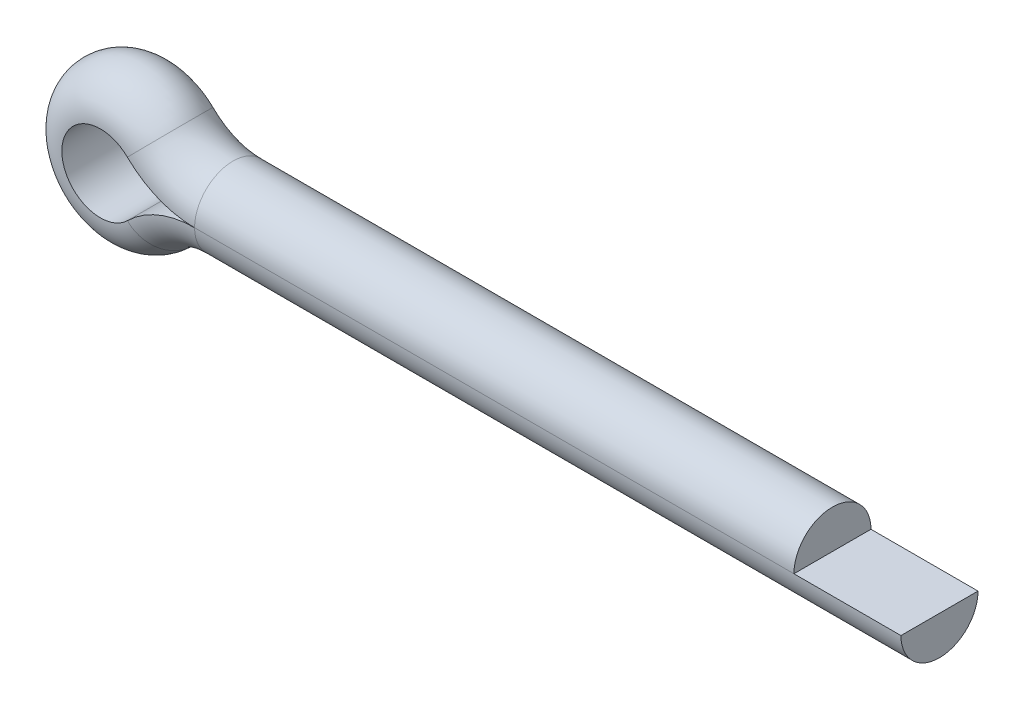
ISO-10303-21;
HEADER;
FILE_DESCRIPTION(('STEP AP214'),'2;1');
FILE_NAME('part.step','',(''),(''),'','','');
FILE_SCHEMA(('AUTOMOTIVE_DESIGN { 1 0 10303 214 1 1 1 1 }'));
ENDSEC;
DATA;
#1=APPLICATION_CONTEXT('core data for automotive mechanical design processes');
#2=APPLICATION_PROTOCOL_DEFINITION('international standard','automotive_design',2000,#1);
#3=PRODUCT_CONTEXT('',#1,'mechanical');
#4=PRODUCT('Part','Part','',(#3));
#5=PRODUCT_RELATED_PRODUCT_CATEGORY('part','',(#4));
#6=PRODUCT_DEFINITION_FORMATION('','',#4);
#7=PRODUCT_DEFINITION_CONTEXT('part definition',#1,'design');
#8=PRODUCT_DEFINITION('design','',#6,#7);
#9=PRODUCT_DEFINITION_SHAPE('','',#8);
#10=(LENGTH_UNIT() NAMED_UNIT(*) SI_UNIT(.MILLI.,.METRE.));
#11=(NAMED_UNIT(*) PLANE_ANGLE_UNIT() SI_UNIT($,.RADIAN.));
#12=(NAMED_UNIT(*) SI_UNIT($,.STERADIAN.) SOLID_ANGLE_UNIT());
#13=UNCERTAINTY_MEASURE_WITH_UNIT(LENGTH_MEASURE(1.E-05),#10,'distance_accuracy_value','');
#14=(GEOMETRIC_REPRESENTATION_CONTEXT(3) GLOBAL_UNCERTAINTY_ASSIGNED_CONTEXT((#13)) GLOBAL_UNIT_ASSIGNED_CONTEXT((#10,
#11,#12)) REPRESENTATION_CONTEXT('',''));
#15=CARTESIAN_POINT('',(0.,0.,0.));
#16=DIRECTION('',(0.,0.,1.));
#17=DIRECTION('',(1.,0.,0.));
#18=AXIS2_PLACEMENT_3D('',#15,#16,#17);
#19=CARTESIAN_POINT('',(3.99999999999989,1.2490009027033E-13,-0.899999999999929));
#20=DIRECTION('',(0.,-1.,0.));
#21=DIRECTION('',(1.,0.,0.));
#22=AXIS2_PLACEMENT_3D('',#19,#20,#21);
#23=PLANE('',#22);
#24=DIRECTION('',(0.,0.,-1.));
#25=VECTOR('',#24,1.);
#26=CARTESIAN_POINT('',(3.99999999999989,1.2490009027033E-13,-0.899999999999929));
#27=LINE('',#26,#25);
#28=CARTESIAN_POINT('',(3.99999999999995,1.11022302462516E-13,0.899999999999956));
#29=VERTEX_POINT('',#28);
#30=CARTESIAN_POINT('',(3.99999999999989,1.2490009027033E-13,-0.899999999999929));
#31=VERTEX_POINT('',#30);
#32=EDGE_CURVE('E138',#29,#31,#27,.T.);
#33=ORIENTED_EDGE('',*,*,#32,.F.);
#34=DIRECTION('',(1.,0.,0.));
#35=VECTOR('',#34,1.);
#36=CARTESIAN_POINT('',(3.99999999999995,1.11022302462516E-13,0.899999999999956));
#37=LINE('',#36,#35);
#38=CARTESIAN_POINT('',(20.5000000000001,1.66533453693773E-13,0.90000000000004));
#39=VERTEX_POINT('',#38);
#40=EDGE_CURVE('E38',#29,#39,#37,.T.);
#41=ORIENTED_EDGE('',*,*,#40,.T.);
#42=DIRECTION('',(0.,0.,-1.));
#43=VECTOR('',#42,1.);
#44=CARTESIAN_POINT('',(20.5,1.52655665885959E-13,-0.899999999999984));
#45=LINE('',#44,#43);
#46=CARTESIAN_POINT('',(20.5,1.52655665885959E-13,-0.899999999999984));
#47=VERTEX_POINT('',#46);
#48=EDGE_CURVE('E45',#39,#47,#45,.T.);
#49=ORIENTED_EDGE('',*,*,#48,.T.);
#50=DIRECTION('',(1.,0.,0.));
#51=VECTOR('',#50,1.);
#52=CARTESIAN_POINT('',(3.99999999999989,1.2490009027033E-13,-0.899999999999929));
#53=LINE('',#52,#51);
#54=EDGE_CURVE('E11',#31,#47,#53,.T.);
#55=ORIENTED_EDGE('',*,*,#54,.F.);
#56=EDGE_LOOP('',(#33,#41,#49,#55));
#57=FACE_BOUND('',#56,.T.);
#58=ADVANCED_FACE('F31',(#57),#23,.F.);
#59=CARTESIAN_POINT('',(3.99999999999998,0.,0.));
#60=DIRECTION('',(1.,0.,0.));
#61=DIRECTION('',(0.,1.,0.));
#62=AXIS2_PLACEMENT_3D('',#59,#60,#61);
#63=CYLINDRICAL_SURFACE('',#62,0.9);
#64=CARTESIAN_POINT('',(3.99999999999998,0.,0.));
#65=DIRECTION('',(-1.,0.,0.));
#66=DIRECTION('',(0.,0.,-1.));
#67=AXIS2_PLACEMENT_3D('',#64,#65,#66);
#68=CIRCLE('',#67,0.9);
#69=EDGE_CURVE('E135',#31,#29,#68,.T.);
#70=ORIENTED_EDGE('',*,*,#69,.F.);
#71=ORIENTED_EDGE('',*,*,#54,.T.);
#72=CARTESIAN_POINT('',(20.5,0.,0.));
#73=DIRECTION('',(-1.,0.,0.));
#74=DIRECTION('',(0.,0.,-1.));
#75=AXIS2_PLACEMENT_3D('',#72,#73,#74);
#76=CIRCLE('',#75,0.9);
#77=EDGE_CURVE('E51',#47,#39,#76,.T.);
#78=ORIENTED_EDGE('',*,*,#77,.T.);
#79=ORIENTED_EDGE('',*,*,#40,.F.);
#80=EDGE_LOOP('',(#70,#71,#78,#79));
#81=FACE_BOUND('',#80,.T.);
#82=ADVANCED_FACE('F150',(#81),#63,.T.);
#83=CARTESIAN_POINT('',(3.99999999999978,-2.23888888888879,0.));
#84=DIRECTION('',(0.,0.,-1.));
#85=DIRECTION('',(-1.,0.,0.));
#86=AXIS2_PLACEMENT_3D('',#83,#84,#85);
#87=CYLINDRICAL_SURFACE('',#86,2.23888888888889);
#88=DIRECTION('',(0.,0.,-1.));
#89=VECTOR('',#88,1.);
#90=CARTESIAN_POINT('',(2.43079646017685,-0.641946902654691,-0.899999999999873));
#91=LINE('',#90,#89);
#92=CARTESIAN_POINT('',(2.43079646017674,-0.641946902654705,0.900000000000067));
#93=VERTEX_POINT('',#92);
#94=CARTESIAN_POINT('',(2.43079646017685,-0.641946902654691,-0.899999999999873));
#95=VERTEX_POINT('',#94);
#96=EDGE_CURVE('E126',#93,#95,#91,.T.);
#97=ORIENTED_EDGE('',*,*,#96,.F.);
#98=CARTESIAN_POINT('',(3.99999999999975,-2.23888888888876,0.90000000000004));
#99=DIRECTION('',(0.,0.,-1.));
#100=DIRECTION('',(-1.,0.,0.));
#101=AXIS2_PLACEMENT_3D('',#98,#99,#100);
#102=CIRCLE('',#101,2.23888888888889);
#103=EDGE_CURVE('E141',#93,#29,#102,.T.);
#104=ORIENTED_EDGE('',*,*,#103,.T.);
#105=ORIENTED_EDGE('',*,*,#32,.T.);
#106=CARTESIAN_POINT('',(3.99999999999989,-2.23888888888868,-0.899999999999956));
#107=DIRECTION('',(0.,0.,-1.));
#108=DIRECTION('',(-1.,0.,0.));
#109=AXIS2_PLACEMENT_3D('',#106,#107,#108);
#110=CIRCLE('',#109,2.23888888888889);
#111=EDGE_CURVE('E144',#95,#31,#110,.T.);
#112=ORIENTED_EDGE('',*,*,#111,.F.);
#113=EDGE_LOOP('',(#97,#104,#105,#112));
#114=FACE_BOUND('',#113,.T.);
#115=ADVANCED_FACE('F154',(#114),#87,.T.);
#116=CARTESIAN_POINT('',(3.99999999999978,-2.23888888888879,0.));
#117=DIRECTION('',(0.,0.,-1.));
#118=DIRECTION('',(-1.,0.,0.));
#119=AXIS2_PLACEMENT_3D('',#116,#117,#118);
#120=TOROIDAL_SURFACE('',#119,2.23888888888889,0.9);
#121=CARTESIAN_POINT('',(2.43079646017696,-0.641946902654691,0.));
#122=DIRECTION('',(-0.713274336283177,-0.700884955752224,0.));
#123=DIRECTION('',(0.,0.,-1.));
#124=AXIS2_PLACEMENT_3D('',#121,#122,#123);
#125=CIRCLE('',#124,0.9);
#126=EDGE_CURVE('E123',#95,#93,#125,.T.);
#127=ORIENTED_EDGE('',*,*,#126,.F.);
#128=ORIENTED_EDGE('',*,*,#111,.T.);
#129=ORIENTED_EDGE('',*,*,#69,.T.);
#130=ORIENTED_EDGE('',*,*,#103,.F.);
#131=EDGE_LOOP('',(#127,#128,#129,#130));
#132=FACE_BOUND('',#131,.T.);
#133=ADVANCED_FACE('F156',(#132),#120,.T.);
#134=CARTESIAN_POINT('',(1.80000000000005,0.,0.));
#135=DIRECTION('',(0.,0.,1.));
#136=DIRECTION('',(1.,0.,0.));
#137=AXIS2_PLACEMENT_3D('',#134,#135,#136);
#138=CYLINDRICAL_SURFACE('',#137,0.899999999999999);
#139=DIRECTION('',(0.,0.,-1.));
#140=VECTOR('',#139,1.);
#141=CARTESIAN_POINT('',(2.43079646017688,0.641946902654913,-0.900000000000012));
#142=LINE('',#141,#140);
#143=CARTESIAN_POINT('',(2.43079646017688,0.641946902654983,0.899999999999984));
#144=VERTEX_POINT('',#143);
#145=CARTESIAN_POINT('',(2.43079646017688,0.641946902654913,-0.900000000000012));
#146=VERTEX_POINT('',#145);
#147=EDGE_CURVE('E95',#144,#146,#142,.T.);
#148=ORIENTED_EDGE('',*,*,#147,.F.);
#149=CARTESIAN_POINT('',(1.79999999999994,1.52655665885959E-13,0.900000000000012));
#150=DIRECTION('',(0.,0.,1.));
#151=DIRECTION('',(1.,0.,0.));
#152=AXIS2_PLACEMENT_3D('',#149,#150,#151);
#153=CIRCLE('',#152,0.899999999999999);
#154=EDGE_CURVE('E129',#144,#93,#153,.T.);
#155=ORIENTED_EDGE('',*,*,#154,.T.);
#156=ORIENTED_EDGE('',*,*,#96,.T.);
#157=CARTESIAN_POINT('',(1.79999999999991,1.2490009027033E-13,-0.899999999999929));
#158=DIRECTION('',(0.,0.,1.));
#159=DIRECTION('',(1.,0.,0.));
#160=AXIS2_PLACEMENT_3D('',#157,#158,#159);
#161=CIRCLE('',#160,0.899999999999999);
#162=EDGE_CURVE('E132',#146,#95,#161,.T.);
#163=ORIENTED_EDGE('',*,*,#162,.F.);
#164=EDGE_LOOP('',(#148,#155,#156,#163));
#165=FACE_BOUND('',#164,.T.);
#166=ADVANCED_FACE('F160',(#165),#138,.F.);
#167=CARTESIAN_POINT('',(1.80000000000005,0.,0.));
#168=DIRECTION('',(0.,0.,1.));
#169=DIRECTION('',(1.,0.,0.));
#170=AXIS2_PLACEMENT_3D('',#167,#168,#169);
#171=DEGENERATE_TOROIDAL_SURFACE('',#170,0.899999999999999,0.9,.T.);
#172=CARTESIAN_POINT('',(2.43079646017694,0.641946902654913,0.));
#173=DIRECTION('',(0.713274336283188,-0.700884955752213,0.));
#174=DIRECTION('',(0.,0.,-1.));
#175=AXIS2_PLACEMENT_3D('',#172,#173,#174);
#176=CIRCLE('',#175,0.9);
#177=EDGE_CURVE('E91',#146,#144,#176,.T.);
#178=ORIENTED_EDGE('',*,*,#177,.F.);
#179=ORIENTED_EDGE('',*,*,#162,.T.);
#180=ORIENTED_EDGE('',*,*,#126,.T.);
#181=ORIENTED_EDGE('',*,*,#154,.F.);
#182=EDGE_LOOP('',(#178,#179,#180,#181));
#183=FACE_BOUND('',#182,.T.);
#184=ADVANCED_FACE('F161',(#183),#171,.T.);
#185=CARTESIAN_POINT('',(4.00000000000011,2.23888888888896,0.));
#186=DIRECTION('',(0.,0.,-1.));
#187=DIRECTION('',(-1.,0.,0.));
#188=AXIS2_PLACEMENT_3D('',#185,#186,#187);
#189=CYLINDRICAL_SURFACE('',#188,2.23888888888889);
#190=DIRECTION('',(0.,0.,-1.));
#191=VECTOR('',#190,1.);
#192=CARTESIAN_POINT('',(3.99999999999989,1.2490009027033E-13,-0.899999999999929));
#193=LINE('',#192,#191);
#194=CARTESIAN_POINT('',(3.99999999999995,1.11022302462516E-13,0.899999999999956));
#195=VERTEX_POINT('',#194);
#196=CARTESIAN_POINT('',(3.99999999999989,1.2490009027033E-13,-0.899999999999929));
#197=VERTEX_POINT('',#196);
#198=EDGE_CURVE('E98',#195,#197,#193,.T.);
#199=ORIENTED_EDGE('',*,*,#198,.F.);
#200=CARTESIAN_POINT('',(3.99999999999995,2.23888888888907,0.900000000000012));
#201=DIRECTION('',(0.,0.,-1.));
#202=DIRECTION('',(-1.,0.,0.));
#203=AXIS2_PLACEMENT_3D('',#200,#201,#202);
#204=CIRCLE('',#203,2.23888888888889);
#205=EDGE_CURVE('E83',#195,#144,#204,.T.);
#206=ORIENTED_EDGE('',*,*,#205,.T.);
#207=ORIENTED_EDGE('',*,*,#147,.T.);
#208=CARTESIAN_POINT('',(3.99999999999992,2.238888888889,-0.899999999999901));
#209=DIRECTION('',(0.,0.,-1.));
#210=DIRECTION('',(-1.,0.,0.));
#211=AXIS2_PLACEMENT_3D('',#208,#209,#210);
#212=CIRCLE('',#211,2.23888888888889);
#213=EDGE_CURVE('E94',#197,#146,#212,.T.);
#214=ORIENTED_EDGE('',*,*,#213,.F.);
#215=EDGE_LOOP('',(#199,#206,#207,#214));
#216=FACE_BOUND('',#215,.T.);
#217=ADVANCED_FACE('F100',(#216),#189,.T.);
#218=CARTESIAN_POINT('',(4.00000000000011,2.23888888888896,0.));
#219=DIRECTION('',(0.,0.,-1.));
#220=DIRECTION('',(-1.,0.,0.));
#221=AXIS2_PLACEMENT_3D('',#218,#219,#220);
#222=TOROIDAL_SURFACE('',#221,2.23888888888889,0.9);
#223=CARTESIAN_POINT('',(3.99999999999998,0.,0.));
#224=DIRECTION('',(1.,0.,0.));
#225=DIRECTION('',(0.,0.,-1.));
#226=AXIS2_PLACEMENT_3D('',#223,#224,#225);
#227=CIRCLE('',#226,0.9);
#228=EDGE_CURVE('E88',#197,#195,#227,.T.);
#229=ORIENTED_EDGE('',*,*,#228,.F.);
#230=ORIENTED_EDGE('',*,*,#213,.T.);
#231=ORIENTED_EDGE('',*,*,#177,.T.);
#232=ORIENTED_EDGE('',*,*,#205,.F.);
#233=EDGE_LOOP('',(#229,#230,#231,#232));
#234=FACE_BOUND('',#233,.T.);
#235=ADVANCED_FACE('F85',(#234),#222,.T.);
#236=CARTESIAN_POINT('',(3.99999999999998,0.,0.));
#237=DIRECTION('',(1.,0.,0.));
#238=DIRECTION('',(0.,1.,0.));
#239=AXIS2_PLACEMENT_3D('',#236,#237,#238);
#240=CYLINDRICAL_SURFACE('',#239,0.9);
#241=CARTESIAN_POINT('',(17.9999999999999,0.,0.));
#242=DIRECTION('',(1.,0.,0.));
#243=DIRECTION('',(0.,0.,-1.));
#244=AXIS2_PLACEMENT_3D('',#241,#242,#243);
#245=CIRCLE('',#244,0.9);
#246=CARTESIAN_POINT('',(18.0000000000001,1.11022302462516E-13,-0.900000000000012));
#247=VERTEX_POINT('',#246);
#248=CARTESIAN_POINT('',(17.9999999999999,0.,0.900000000000067));
#249=VERTEX_POINT('',#248);
#250=EDGE_CURVE('E115',#247,#249,#245,.T.);
#251=ORIENTED_EDGE('',*,*,#250,.F.);
#252=DIRECTION('',(1.,0.,0.));
#253=VECTOR('',#252,1.);
#254=CARTESIAN_POINT('',(3.99999999999989,1.2490009027033E-13,-0.899999999999929));
#255=LINE('',#254,#253);
#256=EDGE_CURVE('E111',#197,#247,#255,.T.);
#257=ORIENTED_EDGE('',*,*,#256,.F.);
#258=ORIENTED_EDGE('',*,*,#228,.T.);
#259=DIRECTION('',(1.,0.,0.));
#260=VECTOR('',#259,1.);
#261=CARTESIAN_POINT('',(3.99999999999995,1.11022302462516E-13,0.899999999999956));
#262=LINE('',#261,#260);
#263=EDGE_CURVE('E102',#195,#249,#262,.T.);
#264=ORIENTED_EDGE('',*,*,#263,.T.);
#265=EDGE_LOOP('',(#251,#257,#258,#264));
#266=FACE_BOUND('',#265,.T.);
#267=ADVANCED_FACE('F113',(#266),#240,.T.);
#268=CARTESIAN_POINT('',(3.99999999999989,1.2490009027033E-13,-0.899999999999929));
#269=DIRECTION('',(0.,-1.,0.));
#270=DIRECTION('',(1.,0.,0.));
#271=AXIS2_PLACEMENT_3D('',#268,#269,#270);
#272=PLANE('',#271);
#273=DIRECTION('',(0.,0.,-1.));
#274=VECTOR('',#273,1.);
#275=CARTESIAN_POINT('',(18.0000000000001,1.11022302462516E-13,-0.900000000000012));
#276=LINE('',#275,#274);
#277=EDGE_CURVE('E107',#249,#247,#276,.T.);
#278=ORIENTED_EDGE('',*,*,#277,.F.);
#279=ORIENTED_EDGE('',*,*,#263,.F.);
#280=ORIENTED_EDGE('',*,*,#198,.T.);
#281=ORIENTED_EDGE('',*,*,#256,.T.);
#282=EDGE_LOOP('',(#278,#279,#280,#281));
#283=FACE_BOUND('',#282,.T.);
#284=ADVANCED_FACE('F105',(#283),#272,.T.);
#285=CARTESIAN_POINT('',(20.5,0.,0.));
#286=DIRECTION('',(-1.,0.,0.));
#287=DIRECTION('',(0.,0.,-1.));
#288=AXIS2_PLACEMENT_3D('',#285,#286,#287);
#289=PLANE('',#288);
#290=ORIENTED_EDGE('',*,*,#77,.F.);
#291=ORIENTED_EDGE('',*,*,#48,.F.);
#292=EDGE_LOOP('',(#290,#291));
#293=FACE_BOUND('',#292,.T.);
#294=ADVANCED_FACE('F213',(#293),#289,.F.);
#295=CARTESIAN_POINT('',(17.9999999999999,0.,0.));
#296=DIRECTION('',(1.,0.,0.));
#297=DIRECTION('',(0.,0.,-1.));
#298=AXIS2_PLACEMENT_3D('',#295,#296,#297);
#299=PLANE('',#298);
#300=ORIENTED_EDGE('',*,*,#250,.T.);
#301=ORIENTED_EDGE('',*,*,#277,.T.);
#302=EDGE_LOOP('',(#300,#301));
#303=FACE_BOUND('',#302,.T.);
#304=ADVANCED_FACE('F220',(#303),#299,.T.);
#305=CLOSED_SHELL('',(#58,#82,#115,#133,#166,#184,#217,#235,#267,#284,#294,#304));
#306=MANIFOLD_SOLID_BREP('B2',#305);
#307=ADVANCED_BREP_SHAPE_REPRESENTATION('',(#18,#306),#14);
#308=SHAPE_DEFINITION_REPRESENTATION(#9,#307);
ENDSEC;
END-ISO-10303-21;
